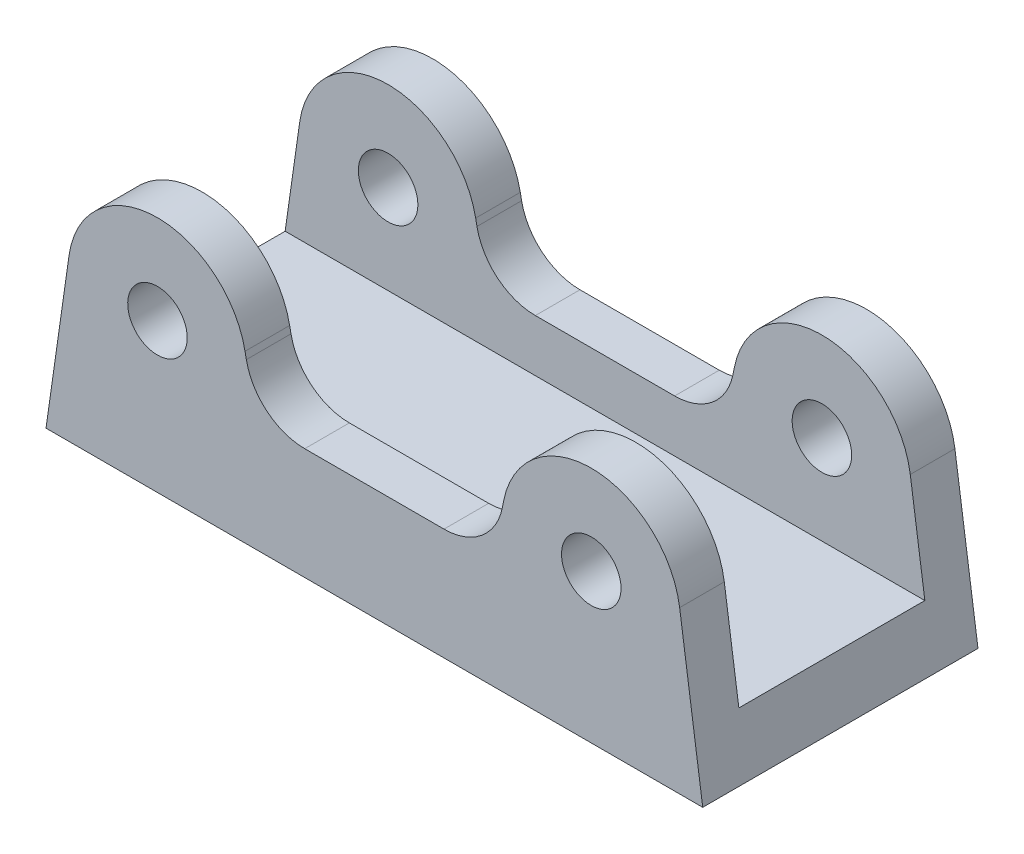
ISO-10303-21;
HEADER;
FILE_DESCRIPTION(('STEP AP214'),'2;1');
FILE_NAME('part.step','',(''),(''),'','','');
FILE_SCHEMA(('AUTOMOTIVE_DESIGN { 1 0 10303 214 1 1 1 1 }'));
ENDSEC;
DATA;
#1=APPLICATION_CONTEXT('core data for automotive mechanical design processes');
#2=APPLICATION_PROTOCOL_DEFINITION('international standard','automotive_design',2000,#1);
#3=PRODUCT_CONTEXT('',#1,'mechanical');
#4=PRODUCT('Part','Part','',(#3));
#5=PRODUCT_RELATED_PRODUCT_CATEGORY('part','',(#4));
#6=PRODUCT_DEFINITION_FORMATION('','',#4);
#7=PRODUCT_DEFINITION_CONTEXT('part definition',#1,'design');
#8=PRODUCT_DEFINITION('design','',#6,#7);
#9=PRODUCT_DEFINITION_SHAPE('','',#8);
#10=(LENGTH_UNIT() NAMED_UNIT(*) SI_UNIT(.MILLI.,.METRE.));
#11=(NAMED_UNIT(*) PLANE_ANGLE_UNIT() SI_UNIT($,.RADIAN.));
#12=(NAMED_UNIT(*) SI_UNIT($,.STERADIAN.) SOLID_ANGLE_UNIT());
#13=UNCERTAINTY_MEASURE_WITH_UNIT(LENGTH_MEASURE(1.E-05),#10,'distance_accuracy_value','');
#14=(GEOMETRIC_REPRESENTATION_CONTEXT(3) GLOBAL_UNCERTAINTY_ASSIGNED_CONTEXT((#13)) GLOBAL_UNIT_ASSIGNED_CONTEXT((#10,
#11,#12)) REPRESENTATION_CONTEXT('',''));
#15=CARTESIAN_POINT('',(0.,0.,0.));
#16=DIRECTION('',(0.,0.,1.));
#17=DIRECTION('',(1.,0.,0.));
#18=AXIS2_PLACEMENT_3D('',#15,#16,#17);
#19=CARTESIAN_POINT('',(-29.155,0.,18.5));
#20=DIRECTION('',(0.,0.,-1.));
#21=DIRECTION('',(-1.,0.,0.));
#22=AXIS2_PLACEMENT_3D('',#19,#20,#21);
#23=CYLINDRICAL_SURFACE('',#22,12.);
#24=DIRECTION('',(0.,0.,-1.));
#25=VECTOR('',#24,1.);
#26=CARTESIAN_POINT('',(-17.3836857304142,2.33155749803532,18.5));
#27=LINE('',#26,#25);
#28=CARTESIAN_POINT('',(-17.3836857304142,2.33155749803532,18.5));
#29=VERTEX_POINT('',#28);
#30=CARTESIAN_POINT('',(-17.3836857304142,2.33155749803532,12.5));
#31=VERTEX_POINT('',#30);
#32=EDGE_CURVE('E188',#29,#31,#27,.T.);
#33=ORIENTED_EDGE('',*,*,#32,.T.);
#34=CARTESIAN_POINT('',(-29.155,0.,12.5));
#35=DIRECTION('',(0.,0.,1.));
#36=DIRECTION('',(0.,-1.,0.));
#37=AXIS2_PLACEMENT_3D('',#34,#35,#36);
#38=CIRCLE('',#37,12.);
#39=CARTESIAN_POINT('',(-41.0341192879015,1.69897761721752,12.5));
#40=VERTEX_POINT('',#39);
#41=EDGE_CURVE('E256',#31,#40,#38,.T.);
#42=ORIENTED_EDGE('',*,*,#41,.T.);
#43=DIRECTION('',(0.,0.,-1.));
#44=VECTOR('',#43,1.);
#45=CARTESIAN_POINT('',(-41.0341192879015,1.69897761721752,18.5));
#46=LINE('',#45,#44);
#47=CARTESIAN_POINT('',(-41.0341192879015,1.69897761721752,18.5));
#48=VERTEX_POINT('',#47);
#49=EDGE_CURVE('E42',#48,#40,#46,.T.);
#50=ORIENTED_EDGE('',*,*,#49,.F.);
#51=CARTESIAN_POINT('',(-29.155,0.,18.5));
#52=DIRECTION('',(0.,0.,1.));
#53=DIRECTION('',(1.,0.,0.));
#54=AXIS2_PLACEMENT_3D('',#51,#52,#53);
#55=CIRCLE('',#54,12.);
#56=EDGE_CURVE('E187',#29,#48,#55,.T.);
#57=ORIENTED_EDGE('',*,*,#56,.F.);
#58=EDGE_LOOP('',(#33,#42,#50,#57));
#59=FACE_BOUND('',#58,.T.);
#60=ADVANCED_FACE('F34',(#59),#23,.T.);
#61=CARTESIAN_POINT('',(29.155,0.,18.5));
#62=DIRECTION('',(0.,0.,-1.));
#63=DIRECTION('',(-1.,0.,0.));
#64=AXIS2_PLACEMENT_3D('',#61,#62,#63);
#65=CYLINDRICAL_SURFACE('',#64,12.);
#66=DIRECTION('',(0.,0.,-1.));
#67=VECTOR('',#66,1.);
#68=CARTESIAN_POINT('',(41.0341192879015,1.69897761721752,18.5));
#69=LINE('',#68,#67);
#70=CARTESIAN_POINT('',(41.0341192879015,1.69897761721752,18.5));
#71=VERTEX_POINT('',#70);
#72=CARTESIAN_POINT('',(41.0341192879015,1.69897761721752,12.5));
#73=VERTEX_POINT('',#72);
#74=EDGE_CURVE('E204',#71,#73,#69,.T.);
#75=ORIENTED_EDGE('',*,*,#74,.T.);
#76=CARTESIAN_POINT('',(29.155,0.,12.5));
#77=DIRECTION('',(0.,0.,1.));
#78=DIRECTION('',(0.,-1.,0.));
#79=AXIS2_PLACEMENT_3D('',#76,#77,#78);
#80=CIRCLE('',#79,12.);
#81=CARTESIAN_POINT('',(17.3836857304142,2.33155749803532,12.5));
#82=VERTEX_POINT('',#81);
#83=EDGE_CURVE('E250',#73,#82,#80,.T.);
#84=ORIENTED_EDGE('',*,*,#83,.T.);
#85=DIRECTION('',(0.,0.,-1.));
#86=VECTOR('',#85,1.);
#87=CARTESIAN_POINT('',(17.3836857304142,2.33155749803532,18.5));
#88=LINE('',#87,#86);
#89=CARTESIAN_POINT('',(17.3836857304142,2.33155749803532,18.5));
#90=VERTEX_POINT('',#89);
#91=EDGE_CURVE('E200',#90,#82,#88,.T.);
#92=ORIENTED_EDGE('',*,*,#91,.F.);
#93=CARTESIAN_POINT('',(29.155,0.,18.5));
#94=DIRECTION('',(0.,0.,1.));
#95=DIRECTION('',(1.,0.,0.));
#96=AXIS2_PLACEMENT_3D('',#93,#94,#95);
#97=CIRCLE('',#96,12.);
#98=EDGE_CURVE('E281',#71,#90,#97,.T.);
#99=ORIENTED_EDGE('',*,*,#98,.F.);
#100=EDGE_LOOP('',(#75,#84,#92,#99));
#101=FACE_BOUND('',#100,.T.);
#102=ADVANCED_FACE('F331',(#101),#65,.T.);
#103=CARTESIAN_POINT('',(17.3836857304142,2.33155749803533,18.5));
#104=DIRECTION('',(0.980942855798827,-0.194296458169575,0.));
#105=DIRECTION('',(0.194296458169575,0.980942855798827,0.));
#106=AXIS2_PLACEMENT_3D('',#103,#104,#105);
#107=PLANE('',#106);
#108=ORIENTED_EDGE('',*,*,#91,.T.);
#109=DIRECTION('',(-0.194296458169575,-0.980942855798827,0.));
#110=VECTOR('',#109,1.);
#111=CARTESIAN_POINT('',(17.3836857304142,2.33155749803533,12.5));
#112=LINE('',#111,#110);
#113=CARTESIAN_POINT('',(17.2082087414962,1.4456283346434,12.5));
#114=VERTEX_POINT('',#113);
#115=EDGE_CURVE('E247',#82,#114,#112,.T.);
#116=ORIENTED_EDGE('',*,*,#115,.T.);
#117=DIRECTION('',(0.,0.,-1.));
#118=VECTOR('',#117,1.);
#119=CARTESIAN_POINT('',(17.2082087414962,1.4456283346434,18.5));
#120=LINE('',#119,#118);
#121=CARTESIAN_POINT('',(17.2082087414962,1.4456283346434,18.5));
#122=VERTEX_POINT('',#121);
#123=EDGE_CURVE('E196',#122,#114,#120,.T.);
#124=ORIENTED_EDGE('',*,*,#123,.F.);
#125=DIRECTION('',(-0.194296458169575,-0.980942855798827,0.));
#126=VECTOR('',#125,1.);
#127=CARTESIAN_POINT('',(17.3836857304142,2.33155749803533,18.5));
#128=LINE('',#127,#126);
#129=EDGE_CURVE('E283',#90,#122,#128,.T.);
#130=ORIENTED_EDGE('',*,*,#129,.F.);
#131=EDGE_LOOP('',(#108,#116,#124,#130));
#132=FACE_BOUND('',#131,.T.);
#133=ADVANCED_FACE('F289',(#132),#107,.F.);
#134=CARTESIAN_POINT('',(9.36066589510556,3.,18.5));
#135=DIRECTION('',(0.,0.,-1.));
#136=DIRECTION('',(-1.,0.,0.));
#137=AXIS2_PLACEMENT_3D('',#134,#135,#136);
#138=CYLINDRICAL_SURFACE('',#137,8.);
#139=ORIENTED_EDGE('',*,*,#123,.T.);
#140=CARTESIAN_POINT('',(9.36066589510556,3.,12.5));
#141=DIRECTION('',(0.,0.,1.));
#142=DIRECTION('',(0.,-1.,0.));
#143=AXIS2_PLACEMENT_3D('',#140,#141,#142);
#144=CIRCLE('',#143,8.);
#145=CARTESIAN_POINT('',(9.36066589510556,-5.,12.5));
#146=VERTEX_POINT('',#145);
#147=EDGE_CURVE('E244',#114,#146,#144,.F.);
#148=ORIENTED_EDGE('',*,*,#147,.T.);
#149=DIRECTION('',(0.,0.,-1.));
#150=VECTOR('',#149,1.);
#151=CARTESIAN_POINT('',(9.36066589510556,-5.,18.5));
#152=LINE('',#151,#150);
#153=CARTESIAN_POINT('',(9.36066589510556,-5.,18.5));
#154=VERTEX_POINT('',#153);
#155=EDGE_CURVE('E193',#154,#146,#152,.T.);
#156=ORIENTED_EDGE('',*,*,#155,.F.);
#157=CARTESIAN_POINT('',(9.36066589510556,3.,18.5));
#158=DIRECTION('',(0.,0.,-1.));
#159=DIRECTION('',(1.,0.,0.));
#160=AXIS2_PLACEMENT_3D('',#157,#158,#159);
#161=CIRCLE('',#160,8.);
#162=EDGE_CURVE('E136',#122,#154,#161,.T.);
#163=ORIENTED_EDGE('',*,*,#162,.F.);
#164=EDGE_LOOP('',(#139,#148,#156,#163));
#165=FACE_BOUND('',#164,.T.);
#166=ADVANCED_FACE('F293',(#165),#138,.F.);
#167=CARTESIAN_POINT('',(-9.36066589510556,-5.,18.5));
#168=DIRECTION('',(0.,-1.,0.));
#169=DIRECTION('',(1.,0.,0.));
#170=AXIS2_PLACEMENT_3D('',#167,#168,#169);
#171=PLANE('',#170);
#172=ORIENTED_EDGE('',*,*,#155,.T.);
#173=DIRECTION('',(-1.,0.,0.));
#174=VECTOR('',#173,1.);
#175=CARTESIAN_POINT('',(-9.36066589510556,-5.,12.5));
#176=LINE('',#175,#174);
#177=CARTESIAN_POINT('',(-9.36066589510556,-5.,12.5));
#178=VERTEX_POINT('',#177);
#179=EDGE_CURVE('E147',#146,#178,#176,.T.);
#180=ORIENTED_EDGE('',*,*,#179,.T.);
#181=DIRECTION('',(0.,0.,-1.));
#182=VECTOR('',#181,1.);
#183=CARTESIAN_POINT('',(-9.36066589510556,-5.,18.5));
#184=LINE('',#183,#182);
#185=CARTESIAN_POINT('',(-9.36066589510556,-5.,18.5));
#186=VERTEX_POINT('',#185);
#187=EDGE_CURVE('E143',#186,#178,#184,.T.);
#188=ORIENTED_EDGE('',*,*,#187,.F.);
#189=DIRECTION('',(-1.,0.,0.));
#190=VECTOR('',#189,1.);
#191=CARTESIAN_POINT('',(-9.36066589510556,-5.,18.5));
#192=LINE('',#191,#190);
#193=EDGE_CURVE('E128',#154,#186,#192,.T.);
#194=ORIENTED_EDGE('',*,*,#193,.F.);
#195=EDGE_LOOP('',(#172,#180,#188,#194));
#196=FACE_BOUND('',#195,.T.);
#197=ADVANCED_FACE('F144',(#196),#171,.F.);
#198=CARTESIAN_POINT('',(-9.36066589510556,3.,18.5));
#199=DIRECTION('',(0.,0.,-1.));
#200=DIRECTION('',(-1.,0.,0.));
#201=AXIS2_PLACEMENT_3D('',#198,#199,#200);
#202=CYLINDRICAL_SURFACE('',#201,8.);
#203=ORIENTED_EDGE('',*,*,#187,.T.);
#204=CARTESIAN_POINT('',(-9.36066589510556,3.,12.5));
#205=DIRECTION('',(0.,0.,1.));
#206=DIRECTION('',(0.,-1.,0.));
#207=AXIS2_PLACEMENT_3D('',#204,#205,#206);
#208=CIRCLE('',#207,8.);
#209=CARTESIAN_POINT('',(-17.2082087414962,1.4456283346434,12.5));
#210=VERTEX_POINT('',#209);
#211=EDGE_CURVE('E241',#178,#210,#208,.F.);
#212=ORIENTED_EDGE('',*,*,#211,.T.);
#213=DIRECTION('',(0.,0.,-1.));
#214=VECTOR('',#213,1.);
#215=CARTESIAN_POINT('',(-17.2082087414962,1.4456283346434,18.5));
#216=LINE('',#215,#214);
#217=CARTESIAN_POINT('',(-17.2082087414962,1.4456283346434,18.5));
#218=VERTEX_POINT('',#217);
#219=EDGE_CURVE('E155',#218,#210,#216,.T.);
#220=ORIENTED_EDGE('',*,*,#219,.F.);
#221=CARTESIAN_POINT('',(-9.36066589510556,3.,18.5));
#222=DIRECTION('',(0.,0.,-1.));
#223=DIRECTION('',(-1.,0.,0.));
#224=AXIS2_PLACEMENT_3D('',#221,#222,#223);
#225=CIRCLE('',#224,8.);
#226=EDGE_CURVE('E133',#186,#218,#225,.T.);
#227=ORIENTED_EDGE('',*,*,#226,.F.);
#228=EDGE_LOOP('',(#203,#212,#220,#227));
#229=FACE_BOUND('',#228,.T.);
#230=ADVANCED_FACE('F153',(#229),#202,.F.);
#231=CARTESIAN_POINT('',(-17.3836857304142,2.33155749803532,18.5));
#232=DIRECTION('',(-0.980942855798827,-0.194296458169575,0.));
#233=DIRECTION('',(0.194296458169575,-0.980942855798827,0.));
#234=AXIS2_PLACEMENT_3D('',#231,#232,#233);
#235=PLANE('',#234);
#236=ORIENTED_EDGE('',*,*,#219,.T.);
#237=DIRECTION('',(-0.194296458169575,0.980942855798827,0.));
#238=VECTOR('',#237,1.);
#239=CARTESIAN_POINT('',(-17.3836857304142,2.33155749803532,12.5));
#240=LINE('',#239,#238);
#241=EDGE_CURVE('E226',#210,#31,#240,.T.);
#242=ORIENTED_EDGE('',*,*,#241,.T.);
#243=ORIENTED_EDGE('',*,*,#32,.F.);
#244=DIRECTION('',(-0.194296458169575,0.980942855798827,0.));
#245=VECTOR('',#244,1.);
#246=CARTESIAN_POINT('',(-17.3836857304142,2.33155749803532,18.5));
#247=LINE('',#246,#245);
#248=EDGE_CURVE('E58',#218,#29,#247,.T.);
#249=ORIENTED_EDGE('',*,*,#248,.F.);
#250=EDGE_LOOP('',(#236,#242,#243,#249));
#251=FACE_BOUND('',#250,.T.);
#252=ADVANCED_FACE('F398',(#251),#235,.F.);
#253=CARTESIAN_POINT('',(29.155,0.,18.5));
#254=DIRECTION('',(0.,0.,-1.));
#255=DIRECTION('',(-1.,0.,0.));
#256=AXIS2_PLACEMENT_3D('',#253,#254,#255);
#257=CYLINDRICAL_SURFACE('',#256,4.00000000000001);
#258=CARTESIAN_POINT('',(29.155,0.,12.5));
#259=DIRECTION('',(0.,0.,1.));
#260=DIRECTION('',(0.,-1.,0.));
#261=AXIS2_PLACEMENT_3D('',#258,#259,#260);
#262=CIRCLE('',#261,4.00000000000001);
#263=CARTESIAN_POINT('',(29.155,-4.00000000000001,12.5));
#264=VERTEX_POINT('',#263);
#265=EDGE_CURVE('E221',#264,#264,#262,.T.);
#266=ORIENTED_EDGE('',*,*,#265,.F.);
#267=EDGE_LOOP('',(#266));
#268=FACE_BOUND('',#267,.T.);
#269=CARTESIAN_POINT('',(29.155,0.,18.5));
#270=DIRECTION('',(0.,0.,1.));
#271=DIRECTION('',(1.,0.,0.));
#272=AXIS2_PLACEMENT_3D('',#269,#270,#271);
#273=CIRCLE('',#272,4.00000000000001);
#274=CARTESIAN_POINT('',(33.155,0.,18.5));
#275=VERTEX_POINT('',#274);
#276=EDGE_CURVE('E163',#275,#275,#273,.T.);
#277=ORIENTED_EDGE('',*,*,#276,.T.);
#278=EDGE_LOOP('',(#277));
#279=FACE_BOUND('',#278,.T.);
#280=ADVANCED_FACE('F448',(#268,#279),#257,.F.);
#281=CARTESIAN_POINT('',(-29.155,0.,18.5));
#282=DIRECTION('',(0.,0.,-1.));
#283=DIRECTION('',(-1.,0.,0.));
#284=AXIS2_PLACEMENT_3D('',#281,#282,#283);
#285=CYLINDRICAL_SURFACE('',#284,4.);
#286=CARTESIAN_POINT('',(-29.155,0.,12.5));
#287=DIRECTION('',(0.,0.,1.));
#288=DIRECTION('',(0.,-1.,0.));
#289=AXIS2_PLACEMENT_3D('',#286,#287,#288);
#290=CIRCLE('',#289,4.);
#291=CARTESIAN_POINT('',(-29.155,-4.,12.5));
#292=VERTEX_POINT('',#291);
#293=EDGE_CURVE('E219',#292,#292,#290,.T.);
#294=ORIENTED_EDGE('',*,*,#293,.F.);
#295=EDGE_LOOP('',(#294));
#296=FACE_BOUND('',#295,.T.);
#297=CARTESIAN_POINT('',(-29.155,0.,18.5));
#298=DIRECTION('',(0.,0.,1.));
#299=DIRECTION('',(1.,0.,0.));
#300=AXIS2_PLACEMENT_3D('',#297,#298,#299);
#301=CIRCLE('',#300,4.);
#302=CARTESIAN_POINT('',(-25.155,0.,18.5));
#303=VERTEX_POINT('',#302);
#304=EDGE_CURVE('E265',#303,#303,#301,.T.);
#305=ORIENTED_EDGE('',*,*,#304,.T.);
#306=EDGE_LOOP('',(#305));
#307=FACE_BOUND('',#306,.T.);
#308=ADVANCED_FACE('F456',(#296,#307),#285,.F.);
#309=CARTESIAN_POINT('',(-29.155,0.,18.5));
#310=DIRECTION('',(0.,0.,1.));
#311=DIRECTION('',(1.,0.,0.));
#312=AXIS2_PLACEMENT_3D('',#309,#310,#311);
#313=PLANE('',#312);
#314=ORIENTED_EDGE('',*,*,#276,.F.);
#315=EDGE_LOOP('',(#314));
#316=FACE_BOUND('',#315,.T.);
#317=ORIENTED_EDGE('',*,*,#56,.T.);
#318=DIRECTION('',(-0.14158146810146,-0.989926607325127,0.));
#319=VECTOR('',#318,1.);
#320=CARTESIAN_POINT('',(-41.0341192879015,1.69897761721752,18.5));
#321=LINE('',#320,#319);
#322=CARTESIAN_POINT('',(-44.1375545169511,-20.,18.5));
#323=VERTEX_POINT('',#322);
#324=EDGE_CURVE('E107',#48,#323,#321,.T.);
#325=ORIENTED_EDGE('',*,*,#324,.T.);
#326=DIRECTION('',(1.,0.,0.));
#327=VECTOR('',#326,1.);
#328=CARTESIAN_POINT('',(-44.1375545169511,-20.,18.5));
#329=LINE('',#328,#327);
#330=CARTESIAN_POINT('',(44.1375545169511,-20.,18.5));
#331=VERTEX_POINT('',#330);
#332=EDGE_CURVE('E277',#323,#331,#329,.T.);
#333=ORIENTED_EDGE('',*,*,#332,.T.);
#334=DIRECTION('',(-0.14158146810146,0.989926607325126,0.));
#335=VECTOR('',#334,1.);
#336=CARTESIAN_POINT('',(41.0341192879015,1.69897761721752,18.5));
#337=LINE('',#336,#335);
#338=EDGE_CURVE('E279',#331,#71,#337,.T.);
#339=ORIENTED_EDGE('',*,*,#338,.T.);
#340=ORIENTED_EDGE('',*,*,#98,.T.);
#341=ORIENTED_EDGE('',*,*,#129,.T.);
#342=ORIENTED_EDGE('',*,*,#162,.T.);
#343=ORIENTED_EDGE('',*,*,#193,.T.);
#344=ORIENTED_EDGE('',*,*,#226,.T.);
#345=ORIENTED_EDGE('',*,*,#248,.T.);
#346=EDGE_LOOP('',(#317,#325,#333,#339,#340,#341,#342,#343,#344,#345));
#347=FACE_BOUND('',#346,.T.);
#348=ORIENTED_EDGE('',*,*,#304,.F.);
#349=EDGE_LOOP('',(#348));
#350=FACE_BOUND('',#349,.T.);
#351=ADVANCED_FACE('F130',(#316,#347,#350),#313,.T.);
#352=CARTESIAN_POINT('',(-29.155,0.,-18.5));
#353=DIRECTION('',(0.,0.,1.));
#354=DIRECTION('',(1.,0.,0.));
#355=AXIS2_PLACEMENT_3D('',#352,#353,#354);
#356=PLANE('',#355);
#357=CARTESIAN_POINT('',(-29.155,0.,-18.5));
#358=DIRECTION('',(0.,0.,1.));
#359=DIRECTION('',(1.,0.,0.));
#360=AXIS2_PLACEMENT_3D('',#357,#358,#359);
#361=CIRCLE('',#360,12.);
#362=CARTESIAN_POINT('',(-17.3836857304142,2.33155749803532,-18.5));
#363=VERTEX_POINT('',#362);
#364=CARTESIAN_POINT('',(-41.0341192879015,1.69897761721752,-18.5));
#365=VERTEX_POINT('',#364);
#366=EDGE_CURVE('E160',#363,#365,#361,.T.);
#367=ORIENTED_EDGE('',*,*,#366,.F.);
#368=DIRECTION('',(-0.194296458169575,0.980942855798827,0.));
#369=VECTOR('',#368,1.);
#370=CARTESIAN_POINT('',(-17.3836857304142,2.33155749803532,-18.5));
#371=LINE('',#370,#369);
#372=CARTESIAN_POINT('',(-17.2082087414962,1.4456283346434,-18.5));
#373=VERTEX_POINT('',#372);
#374=EDGE_CURVE('E185',#373,#363,#371,.T.);
#375=ORIENTED_EDGE('',*,*,#374,.F.);
#376=CARTESIAN_POINT('',(-9.36066589510556,3.,-18.5));
#377=DIRECTION('',(0.,0.,-1.));
#378=DIRECTION('',(-1.,0.,0.));
#379=AXIS2_PLACEMENT_3D('',#376,#377,#378);
#380=CIRCLE('',#379,8.);
#381=CARTESIAN_POINT('',(-9.36066589510556,-5.,-18.5));
#382=VERTEX_POINT('',#381);
#383=EDGE_CURVE('E182',#382,#373,#380,.T.);
#384=ORIENTED_EDGE('',*,*,#383,.F.);
#385=DIRECTION('',(-1.,0.,0.));
#386=VECTOR('',#385,1.);
#387=CARTESIAN_POINT('',(-9.36066589510556,-5.,-18.5));
#388=LINE('',#387,#386);
#389=CARTESIAN_POINT('',(9.36066589510556,-5.,-18.5));
#390=VERTEX_POINT('',#389);
#391=EDGE_CURVE('E179',#390,#382,#388,.T.);
#392=ORIENTED_EDGE('',*,*,#391,.F.);
#393=CARTESIAN_POINT('',(9.36066589510556,3.,-18.5));
#394=DIRECTION('',(0.,0.,-1.));
#395=DIRECTION('',(1.,0.,0.));
#396=AXIS2_PLACEMENT_3D('',#393,#394,#395);
#397=CIRCLE('',#396,8.);
#398=CARTESIAN_POINT('',(17.2082087414962,1.4456283346434,-18.5));
#399=VERTEX_POINT('',#398);
#400=EDGE_CURVE('E176',#399,#390,#397,.T.);
#401=ORIENTED_EDGE('',*,*,#400,.F.);
#402=DIRECTION('',(-0.194296458169575,-0.980942855798827,0.));
#403=VECTOR('',#402,1.);
#404=CARTESIAN_POINT('',(17.3836857304142,2.33155749803533,-18.5));
#405=LINE('',#404,#403);
#406=CARTESIAN_POINT('',(17.3836857304142,2.33155749803532,-18.5));
#407=VERTEX_POINT('',#406);
#408=EDGE_CURVE('E173',#407,#399,#405,.T.);
#409=ORIENTED_EDGE('',*,*,#408,.F.);
#410=CARTESIAN_POINT('',(29.155,0.,-18.5));
#411=DIRECTION('',(0.,0.,1.));
#412=DIRECTION('',(1.,0.,0.));
#413=AXIS2_PLACEMENT_3D('',#410,#411,#412);
#414=CIRCLE('',#413,12.);
#415=CARTESIAN_POINT('',(41.0341192879015,1.69897761721752,-18.5));
#416=VERTEX_POINT('',#415);
#417=EDGE_CURVE('E170',#416,#407,#414,.T.);
#418=ORIENTED_EDGE('',*,*,#417,.F.);
#419=DIRECTION('',(-0.14158146810146,0.989926607325126,0.));
#420=VECTOR('',#419,1.);
#421=CARTESIAN_POINT('',(41.0341192879015,1.69897761721752,-18.5));
#422=LINE('',#421,#420);
#423=CARTESIAN_POINT('',(44.1375545169511,-20.,-18.5));
#424=VERTEX_POINT('',#423);
#425=EDGE_CURVE('E167',#424,#416,#422,.T.);
#426=ORIENTED_EDGE('',*,*,#425,.F.);
#427=DIRECTION('',(1.,0.,0.));
#428=VECTOR('',#427,1.);
#429=CARTESIAN_POINT('',(-44.1375545169511,-20.,-18.5));
#430=LINE('',#429,#428);
#431=CARTESIAN_POINT('',(-44.1375545169511,-20.,-18.5));
#432=VERTEX_POINT('',#431);
#433=EDGE_CURVE('E165',#432,#424,#430,.T.);
#434=ORIENTED_EDGE('',*,*,#433,.F.);
#435=DIRECTION('',(-0.14158146810146,-0.989926607325127,0.));
#436=VECTOR('',#435,1.);
#437=CARTESIAN_POINT('',(-41.0341192879015,1.69897761721752,-18.5));
#438=LINE('',#437,#436);
#439=EDGE_CURVE('E162',#365,#432,#438,.T.);
#440=ORIENTED_EDGE('',*,*,#439,.F.);
#441=EDGE_LOOP('',(#367,#375,#384,#392,#401,#409,#418,#426,#434,#440));
#442=FACE_BOUND('',#441,.T.);
#443=CARTESIAN_POINT('',(29.155,0.,-18.5));
#444=DIRECTION('',(0.,0.,1.));
#445=DIRECTION('',(1.,0.,0.));
#446=AXIS2_PLACEMENT_3D('',#443,#444,#445);
#447=CIRCLE('',#446,4.00000000000001);
#448=CARTESIAN_POINT('',(33.155,0.,-18.5));
#449=VERTEX_POINT('',#448);
#450=EDGE_CURVE('E268',#449,#449,#447,.T.);
#451=ORIENTED_EDGE('',*,*,#450,.T.);
#452=EDGE_LOOP('',(#451));
#453=FACE_BOUND('',#452,.T.);
#454=CARTESIAN_POINT('',(-29.155,0.,-18.5));
#455=DIRECTION('',(0.,0.,1.));
#456=DIRECTION('',(1.,0.,0.));
#457=AXIS2_PLACEMENT_3D('',#454,#455,#456);
#458=CIRCLE('',#457,4.);
#459=CARTESIAN_POINT('',(-25.155,0.,-18.5));
#460=VERTEX_POINT('',#459);
#461=EDGE_CURVE('E264',#460,#460,#458,.T.);
#462=ORIENTED_EDGE('',*,*,#461,.T.);
#463=EDGE_LOOP('',(#462));
#464=FACE_BOUND('',#463,.T.);
#465=ADVANCED_FACE('F329',(#442,#453,#464),#356,.F.);
#466=CARTESIAN_POINT('',(-41.0341192879015,1.69897761721752,-12.5));
#467=VERTEX_POINT('',#466);
#468=EDGE_CURVE('E213',#467,#365,#46,.T.);
#469=ORIENTED_EDGE('',*,*,#468,.F.);
#470=CARTESIAN_POINT('',(-29.155,0.,-12.5));
#471=DIRECTION('',(0.,0.,-1.));
#472=DIRECTION('',(0.,1.,0.));
#473=AXIS2_PLACEMENT_3D('',#470,#471,#472);
#474=CIRCLE('',#473,12.);
#475=CARTESIAN_POINT('',(-17.3836857304142,2.33155749803532,-12.5));
#476=VERTEX_POINT('',#475);
#477=EDGE_CURVE('E229',#467,#476,#474,.T.);
#478=ORIENTED_EDGE('',*,*,#477,.T.);
#479=EDGE_CURVE('E98',#476,#363,#27,.T.);
#480=ORIENTED_EDGE('',*,*,#479,.T.);
#481=ORIENTED_EDGE('',*,*,#366,.T.);
#482=EDGE_LOOP('',(#469,#478,#480,#481));
#483=FACE_BOUND('',#482,.T.);
#484=ADVANCED_FACE('F36',(#483),#23,.T.);
#485=CARTESIAN_POINT('',(-41.0341192879015,1.69897761721752,18.5));
#486=DIRECTION('',(0.989926607325127,-0.14158146810146,0.));
#487=DIRECTION('',(0.14158146810146,0.989926607325127,0.));
#488=AXIS2_PLACEMENT_3D('',#485,#486,#487);
#489=PLANE('',#488);
#490=ORIENTED_EDGE('',*,*,#49,.T.);
#491=DIRECTION('',(-0.14158146810146,-0.989926607325127,0.));
#492=VECTOR('',#491,1.);
#493=CARTESIAN_POINT('',(-41.0341192879015,1.69897761721752,12.5));
#494=LINE('',#493,#492);
#495=CARTESIAN_POINT('',(-42.9933770229527,-12.,12.5));
#496=VERTEX_POINT('',#495);
#497=EDGE_CURVE('E259',#40,#496,#494,.T.);
#498=ORIENTED_EDGE('',*,*,#497,.T.);
#499=DIRECTION('',(0.,0.,-1.));
#500=VECTOR('',#499,1.);
#501=CARTESIAN_POINT('',(-42.9933770229527,-12.,18.5));
#502=LINE('',#501,#500);
#503=CARTESIAN_POINT('',(-42.9933770229527,-12.,-12.5));
#504=VERTEX_POINT('',#503);
#505=EDGE_CURVE('E262',#496,#504,#502,.T.);
#506=ORIENTED_EDGE('',*,*,#505,.T.);
#507=DIRECTION('',(0.14158146810146,0.989926607325127,0.));
#508=VECTOR('',#507,1.);
#509=CARTESIAN_POINT('',(-41.0341192879015,1.69897761721752,-12.5));
#510=LINE('',#509,#508);
#511=EDGE_CURVE('E222',#504,#467,#510,.T.);
#512=ORIENTED_EDGE('',*,*,#511,.T.);
#513=ORIENTED_EDGE('',*,*,#468,.T.);
#514=ORIENTED_EDGE('',*,*,#439,.T.);
#515=DIRECTION('',(0.,0.,-1.));
#516=VECTOR('',#515,1.);
#517=CARTESIAN_POINT('',(-44.1375545169511,-20.,18.5));
#518=LINE('',#517,#516);
#519=EDGE_CURVE('E210',#323,#432,#518,.T.);
#520=ORIENTED_EDGE('',*,*,#519,.F.);
#521=ORIENTED_EDGE('',*,*,#324,.F.);
#522=EDGE_LOOP('',(#490,#498,#506,#512,#513,#514,#520,#521));
#523=FACE_BOUND('',#522,.T.);
#524=ADVANCED_FACE('F319',(#523),#489,.F.);
#525=CARTESIAN_POINT('',(-44.1375545169511,-20.,18.5));
#526=DIRECTION('',(0.,1.,0.));
#527=DIRECTION('',(-1.,0.,0.));
#528=AXIS2_PLACEMENT_3D('',#525,#526,#527);
#529=PLANE('',#528);
#530=ORIENTED_EDGE('',*,*,#433,.T.);
#531=DIRECTION('',(0.,0.,-1.));
#532=VECTOR('',#531,1.);
#533=CARTESIAN_POINT('',(44.1375545169511,-20.,18.5));
#534=LINE('',#533,#532);
#535=EDGE_CURVE('E207',#331,#424,#534,.T.);
#536=ORIENTED_EDGE('',*,*,#535,.F.);
#537=ORIENTED_EDGE('',*,*,#332,.F.);
#538=ORIENTED_EDGE('',*,*,#519,.T.);
#539=EDGE_LOOP('',(#530,#536,#537,#538));
#540=FACE_BOUND('',#539,.T.);
#541=ADVANCED_FACE('F321',(#540),#529,.F.);
#542=CARTESIAN_POINT('',(41.0341192879015,1.69897761721752,18.5));
#543=DIRECTION('',(-0.989926607325127,-0.14158146810146,0.));
#544=DIRECTION('',(0.14158146810146,-0.989926607325126,0.));
#545=AXIS2_PLACEMENT_3D('',#542,#543,#544);
#546=PLANE('',#545);
#547=DIRECTION('',(0.,0.,1.));
#548=VECTOR('',#547,1.);
#549=CARTESIAN_POINT('',(42.9933770229527,-12.,18.5));
#550=LINE('',#549,#548);
#551=CARTESIAN_POINT('',(42.9933770229527,-12.,-12.5));
#552=VERTEX_POINT('',#551);
#553=CARTESIAN_POINT('',(42.9933770229527,-12.,12.5));
#554=VERTEX_POINT('',#553);
#555=EDGE_CURVE('E11',#552,#554,#550,.T.);
#556=ORIENTED_EDGE('',*,*,#555,.T.);
#557=DIRECTION('',(-0.14158146810146,0.989926607325126,0.));
#558=VECTOR('',#557,1.);
#559=CARTESIAN_POINT('',(41.0341192879015,1.69897761721752,12.5));
#560=LINE('',#559,#558);
#561=EDGE_CURVE('E253',#554,#73,#560,.T.);
#562=ORIENTED_EDGE('',*,*,#561,.T.);
#563=ORIENTED_EDGE('',*,*,#74,.F.);
#564=ORIENTED_EDGE('',*,*,#338,.F.);
#565=ORIENTED_EDGE('',*,*,#535,.T.);
#566=ORIENTED_EDGE('',*,*,#425,.T.);
#567=CARTESIAN_POINT('',(41.0341192879015,1.69897761721752,-12.5));
#568=VERTEX_POINT('',#567);
#569=EDGE_CURVE('E203',#568,#416,#69,.T.);
#570=ORIENTED_EDGE('',*,*,#569,.F.);
#571=DIRECTION('',(0.14158146810146,-0.989926607325126,0.));
#572=VECTOR('',#571,1.);
#573=CARTESIAN_POINT('',(41.0341192879015,1.69897761721752,-12.5));
#574=LINE('',#573,#572);
#575=EDGE_CURVE('E235',#568,#552,#574,.T.);
#576=ORIENTED_EDGE('',*,*,#575,.T.);
#577=EDGE_LOOP('',(#556,#562,#563,#564,#565,#566,#570,#576));
#578=FACE_BOUND('',#577,.T.);
#579=ADVANCED_FACE('F326',(#578),#546,.F.);
#580=CARTESIAN_POINT('',(17.3836857304142,2.33155749803532,-12.5));
#581=VERTEX_POINT('',#580);
#582=EDGE_CURVE('E199',#581,#407,#88,.T.);
#583=ORIENTED_EDGE('',*,*,#582,.F.);
#584=CARTESIAN_POINT('',(29.155,0.,-12.5));
#585=DIRECTION('',(0.,0.,-1.));
#586=DIRECTION('',(0.,1.,0.));
#587=AXIS2_PLACEMENT_3D('',#584,#585,#586);
#588=CIRCLE('',#587,12.);
#589=EDGE_CURVE('E358',#581,#568,#588,.T.);
#590=ORIENTED_EDGE('',*,*,#589,.T.);
#591=ORIENTED_EDGE('',*,*,#569,.T.);
#592=ORIENTED_EDGE('',*,*,#417,.T.);
#593=EDGE_LOOP('',(#583,#590,#591,#592));
#594=FACE_BOUND('',#593,.T.);
#595=ADVANCED_FACE('F337',(#594),#65,.T.);
#596=CARTESIAN_POINT('',(17.2082087414962,1.4456283346434,-12.5));
#597=VERTEX_POINT('',#596);
#598=EDGE_CURVE('E195',#597,#399,#120,.T.);
#599=ORIENTED_EDGE('',*,*,#598,.F.);
#600=DIRECTION('',(0.194296458169575,0.980942855798827,0.));
#601=VECTOR('',#600,1.);
#602=CARTESIAN_POINT('',(17.3836857304142,2.33155749803532,-12.5));
#603=LINE('',#602,#601);
#604=EDGE_CURVE('E368',#597,#581,#603,.T.);
#605=ORIENTED_EDGE('',*,*,#604,.T.);
#606=ORIENTED_EDGE('',*,*,#582,.T.);
#607=ORIENTED_EDGE('',*,*,#408,.T.);
#608=EDGE_LOOP('',(#599,#605,#606,#607));
#609=FACE_BOUND('',#608,.T.);
#610=ADVANCED_FACE('F342',(#609),#107,.F.);
#611=CARTESIAN_POINT('',(9.36066589510556,-5.,-12.5));
#612=VERTEX_POINT('',#611);
#613=EDGE_CURVE('E150',#612,#390,#152,.T.);
#614=ORIENTED_EDGE('',*,*,#613,.F.);
#615=CARTESIAN_POINT('',(9.36066589510556,3.,-12.5));
#616=DIRECTION('',(0.,0.,-1.));
#617=DIRECTION('',(0.,1.,0.));
#618=AXIS2_PLACEMENT_3D('',#615,#616,#617);
#619=CIRCLE('',#618,8.);
#620=EDGE_CURVE('E371',#612,#597,#619,.F.);
#621=ORIENTED_EDGE('',*,*,#620,.T.);
#622=ORIENTED_EDGE('',*,*,#598,.T.);
#623=ORIENTED_EDGE('',*,*,#400,.T.);
#624=EDGE_LOOP('',(#614,#621,#622,#623));
#625=FACE_BOUND('',#624,.T.);
#626=ADVANCED_FACE('F350',(#625),#138,.F.);
#627=CARTESIAN_POINT('',(-9.36066589510556,-5.,-12.5));
#628=VERTEX_POINT('',#627);
#629=EDGE_CURVE('E151',#628,#382,#184,.T.);
#630=ORIENTED_EDGE('',*,*,#629,.F.);
#631=DIRECTION('',(1.,0.,0.));
#632=VECTOR('',#631,1.);
#633=CARTESIAN_POINT('',(-9.36066589510556,-5.,-12.5));
#634=LINE('',#633,#632);
#635=EDGE_CURVE('E374',#628,#612,#634,.T.);
#636=ORIENTED_EDGE('',*,*,#635,.T.);
#637=ORIENTED_EDGE('',*,*,#613,.T.);
#638=ORIENTED_EDGE('',*,*,#391,.T.);
#639=EDGE_LOOP('',(#630,#636,#637,#638));
#640=FACE_BOUND('',#639,.T.);
#641=ADVANCED_FACE('F420',(#640),#171,.F.);
#642=CARTESIAN_POINT('',(-17.2082087414962,1.4456283346434,-12.5));
#643=VERTEX_POINT('',#642);
#644=EDGE_CURVE('E191',#643,#373,#216,.T.);
#645=ORIENTED_EDGE('',*,*,#644,.F.);
#646=CARTESIAN_POINT('',(-9.36066589510556,3.,-12.5));
#647=DIRECTION('',(0.,0.,-1.));
#648=DIRECTION('',(0.,1.,0.));
#649=AXIS2_PLACEMENT_3D('',#646,#647,#648);
#650=CIRCLE('',#649,8.);
#651=EDGE_CURVE('E49',#643,#628,#650,.F.);
#652=ORIENTED_EDGE('',*,*,#651,.T.);
#653=ORIENTED_EDGE('',*,*,#629,.T.);
#654=ORIENTED_EDGE('',*,*,#383,.T.);
#655=EDGE_LOOP('',(#645,#652,#653,#654));
#656=FACE_BOUND('',#655,.T.);
#657=ADVANCED_FACE('F432',(#656),#202,.F.);
#658=ORIENTED_EDGE('',*,*,#479,.F.);
#659=DIRECTION('',(0.194296458169575,-0.980942855798827,0.));
#660=VECTOR('',#659,1.);
#661=CARTESIAN_POINT('',(-17.3836857304142,2.33155749803532,-12.5));
#662=LINE('',#661,#660);
#663=EDGE_CURVE('E413',#476,#643,#662,.T.);
#664=ORIENTED_EDGE('',*,*,#663,.T.);
#665=ORIENTED_EDGE('',*,*,#644,.T.);
#666=ORIENTED_EDGE('',*,*,#374,.T.);
#667=EDGE_LOOP('',(#658,#664,#665,#666));
#668=FACE_BOUND('',#667,.T.);
#669=ADVANCED_FACE('F437',(#668),#235,.F.);
#670=CARTESIAN_POINT('',(29.155,0.,-12.5));
#671=DIRECTION('',(0.,0.,-1.));
#672=DIRECTION('',(0.,1.,0.));
#673=AXIS2_PLACEMENT_3D('',#670,#671,#672);
#674=CIRCLE('',#673,4.00000000000001);
#675=CARTESIAN_POINT('',(29.155,4.00000000000001,-12.5));
#676=VERTEX_POINT('',#675);
#677=EDGE_CURVE('E217',#676,#676,#674,.T.);
#678=ORIENTED_EDGE('',*,*,#677,.F.);
#679=EDGE_LOOP('',(#678));
#680=FACE_BOUND('',#679,.T.);
#681=ORIENTED_EDGE('',*,*,#450,.F.);
#682=EDGE_LOOP('',(#681));
#683=FACE_BOUND('',#682,.T.);
#684=ADVANCED_FACE('F439',(#680,#683),#257,.F.);
#685=CARTESIAN_POINT('',(-29.155,0.,-12.5));
#686=DIRECTION('',(0.,0.,-1.));
#687=DIRECTION('',(0.,1.,0.));
#688=AXIS2_PLACEMENT_3D('',#685,#686,#687);
#689=CIRCLE('',#688,4.);
#690=CARTESIAN_POINT('',(-29.155,4.,-12.5));
#691=VERTEX_POINT('',#690);
#692=EDGE_CURVE('E215',#691,#691,#689,.T.);
#693=ORIENTED_EDGE('',*,*,#692,.F.);
#694=EDGE_LOOP('',(#693));
#695=FACE_BOUND('',#694,.T.);
#696=ORIENTED_EDGE('',*,*,#461,.F.);
#697=EDGE_LOOP('',(#696));
#698=FACE_BOUND('',#697,.T.);
#699=ADVANCED_FACE('F445',(#695,#698),#285,.F.);
#700=CARTESIAN_POINT('',(-50.,-12.,12.5));
#701=DIRECTION('',(0.,-1.,0.));
#702=DIRECTION('',(0.,0.,-1.));
#703=AXIS2_PLACEMENT_3D('',#700,#701,#702);
#704=PLANE('',#703);
#705=DIRECTION('',(1.,0.,0.));
#706=VECTOR('',#705,1.);
#707=CARTESIAN_POINT('',(-50.,-12.,12.5));
#708=LINE('',#707,#706);
#709=EDGE_CURVE('E315',#496,#554,#708,.T.);
#710=ORIENTED_EDGE('',*,*,#709,.T.);
#711=ORIENTED_EDGE('',*,*,#555,.F.);
#712=DIRECTION('',(1.,0.,0.));
#713=VECTOR('',#712,1.);
#714=CARTESIAN_POINT('',(-50.,-12.,-12.5));
#715=LINE('',#714,#713);
#716=EDGE_CURVE('E218',#504,#552,#715,.T.);
#717=ORIENTED_EDGE('',*,*,#716,.F.);
#718=ORIENTED_EDGE('',*,*,#505,.F.);
#719=EDGE_LOOP('',(#710,#711,#717,#718));
#720=FACE_BOUND('',#719,.T.);
#721=ADVANCED_FACE('F407',(#720),#704,.F.);
#722=CARTESIAN_POINT('',(-50.,14.4969501030928,12.5));
#723=DIRECTION('',(0.,0.,1.));
#724=DIRECTION('',(0.,-1.,0.));
#725=AXIS2_PLACEMENT_3D('',#722,#723,#724);
#726=PLANE('',#725);
#727=ORIENTED_EDGE('',*,*,#265,.T.);
#728=EDGE_LOOP('',(#727));
#729=FACE_BOUND('',#728,.T.);
#730=ORIENTED_EDGE('',*,*,#293,.T.);
#731=EDGE_LOOP('',(#730));
#732=FACE_BOUND('',#731,.T.);
#733=ORIENTED_EDGE('',*,*,#41,.F.);
#734=ORIENTED_EDGE('',*,*,#241,.F.);
#735=ORIENTED_EDGE('',*,*,#211,.F.);
#736=ORIENTED_EDGE('',*,*,#179,.F.);
#737=ORIENTED_EDGE('',*,*,#147,.F.);
#738=ORIENTED_EDGE('',*,*,#115,.F.);
#739=ORIENTED_EDGE('',*,*,#83,.F.);
#740=ORIENTED_EDGE('',*,*,#561,.F.);
#741=ORIENTED_EDGE('',*,*,#709,.F.);
#742=ORIENTED_EDGE('',*,*,#497,.F.);
#743=EDGE_LOOP('',(#733,#734,#735,#736,#737,#738,#739,#740,#741,#742));
#744=FACE_BOUND('',#743,.T.);
#745=ADVANCED_FACE('F311',(#729,#732,#744),#726,.F.);
#746=CARTESIAN_POINT('',(-50.,14.4969501030928,-12.5));
#747=DIRECTION('',(0.,0.,-1.));
#748=DIRECTION('',(0.,1.,0.));
#749=AXIS2_PLACEMENT_3D('',#746,#747,#748);
#750=PLANE('',#749);
#751=ORIENTED_EDGE('',*,*,#677,.T.);
#752=EDGE_LOOP('',(#751));
#753=FACE_BOUND('',#752,.T.);
#754=ORIENTED_EDGE('',*,*,#692,.T.);
#755=EDGE_LOOP('',(#754));
#756=FACE_BOUND('',#755,.T.);
#757=ORIENTED_EDGE('',*,*,#716,.T.);
#758=ORIENTED_EDGE('',*,*,#575,.F.);
#759=ORIENTED_EDGE('',*,*,#589,.F.);
#760=ORIENTED_EDGE('',*,*,#604,.F.);
#761=ORIENTED_EDGE('',*,*,#620,.F.);
#762=ORIENTED_EDGE('',*,*,#635,.F.);
#763=ORIENTED_EDGE('',*,*,#651,.F.);
#764=ORIENTED_EDGE('',*,*,#663,.F.);
#765=ORIENTED_EDGE('',*,*,#477,.F.);
#766=ORIENTED_EDGE('',*,*,#511,.F.);
#767=EDGE_LOOP('',(#757,#758,#759,#760,#761,#762,#763,#764,#765,#766));
#768=FACE_BOUND('',#767,.T.);
#769=ADVANCED_FACE('F386',(#753,#756,#768),#750,.F.);
#770=CLOSED_SHELL('',(#60,#102,#133,#166,#197,#230,#252,#280,#308,#351,#465,#484,#524,#541,#579,
#595,#610,#626,#641,#657,#669,#684,#699,#721,#745,#769));
#771=MANIFOLD_SOLID_BREP('B2',#770);
#772=ADVANCED_BREP_SHAPE_REPRESENTATION('',(#18,#771),#14);
#773=SHAPE_DEFINITION_REPRESENTATION(#9,#772);
ENDSEC;
END-ISO-10303-21;
